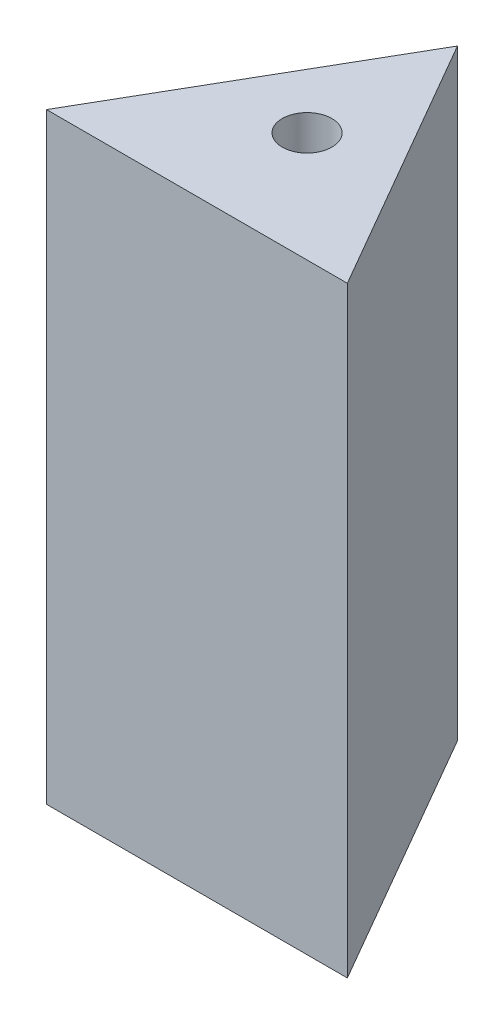
ISO-10303-21;
HEADER;
FILE_DESCRIPTION(('STEP AP214'),'2;1');
FILE_NAME('part.step','',(''),(''),'','','');
FILE_SCHEMA(('AUTOMOTIVE_DESIGN { 1 0 10303 214 1 1 1 1 }'));
ENDSEC;
DATA;
#1=APPLICATION_CONTEXT('core data for automotive mechanical design processes');
#2=APPLICATION_PROTOCOL_DEFINITION('international standard','automotive_design',2000,#1);
#3=PRODUCT_CONTEXT('',#1,'mechanical');
#4=PRODUCT('Part','Part','',(#3));
#5=PRODUCT_RELATED_PRODUCT_CATEGORY('part','',(#4));
#6=PRODUCT_DEFINITION_FORMATION('','',#4);
#7=PRODUCT_DEFINITION_CONTEXT('part definition',#1,'design');
#8=PRODUCT_DEFINITION('design','',#6,#7);
#9=PRODUCT_DEFINITION_SHAPE('','',#8);
#10=(LENGTH_UNIT() NAMED_UNIT(*) SI_UNIT(.MILLI.,.METRE.));
#11=(NAMED_UNIT(*) PLANE_ANGLE_UNIT() SI_UNIT($,.RADIAN.));
#12=(NAMED_UNIT(*) SI_UNIT($,.STERADIAN.) SOLID_ANGLE_UNIT());
#13=UNCERTAINTY_MEASURE_WITH_UNIT(LENGTH_MEASURE(1.E-05),#10,'distance_accuracy_value','');
#14=(GEOMETRIC_REPRESENTATION_CONTEXT(3) GLOBAL_UNCERTAINTY_ASSIGNED_CONTEXT((#13)) GLOBAL_UNIT_ASSIGNED_CONTEXT((#10,
#11,#12)) REPRESENTATION_CONTEXT('',''));
#15=CARTESIAN_POINT('',(0.,0.,0.));
#16=DIRECTION('',(0.,0.,1.));
#17=DIRECTION('',(1.,0.,0.));
#18=AXIS2_PLACEMENT_3D('',#15,#16,#17);
#19=CARTESIAN_POINT('',(0.,40.,0.));
#20=DIRECTION('',(-0.86602540378444,0.,-0.499999999999998));
#21=DIRECTION('',(-0.499999999999998,0.,0.86602540378444));
#22=AXIS2_PLACEMENT_3D('',#19,#20,#21);
#23=PLANE('',#22);
#24=CARTESIAN_POINT('',(4.99999999999998,35.,-8.6602540378444));
#25=DIRECTION('',(-0.86602540378444,0.,-0.499999999999998));
#26=DIRECTION('',(-0.499999999999998,0.,0.86602540378444));
#27=AXIS2_PLACEMENT_3D('',#24,#25,#26);
#28=CIRCLE('',#27,1.64999999999999);
#29=CARTESIAN_POINT('',(4.17499999999998,35.,-7.23131212160008));
#30=VERTEX_POINT('',#29);
#31=EDGE_CURVE('E112',#30,#30,#28,.T.);
#32=ORIENTED_EDGE('',*,*,#31,.F.);
#33=EDGE_LOOP('',(#32));
#34=FACE_BOUND('',#33,.T.);
#35=CARTESIAN_POINT('',(4.99999999999998,5.,-8.6602540378444));
#36=DIRECTION('',(-0.86602540378444,0.,-0.499999999999998));
#37=DIRECTION('',(-0.499999999999998,0.,0.86602540378444));
#38=AXIS2_PLACEMENT_3D('',#35,#36,#37);
#39=CIRCLE('',#38,1.64999999999999);
#40=CARTESIAN_POINT('',(4.17499999999999,5.,-7.23131212160008));
#41=VERTEX_POINT('',#40);
#42=EDGE_CURVE('E118',#41,#41,#39,.T.);
#43=ORIENTED_EDGE('',*,*,#42,.F.);
#44=EDGE_LOOP('',(#43));
#45=FACE_BOUND('',#44,.T.);
#46=DIRECTION('',(0.499999999999998,0.,-0.86602540378444));
#47=VECTOR('',#46,1.);
#48=CARTESIAN_POINT('',(0.,0.,0.));
#49=LINE('',#48,#47);
#50=CARTESIAN_POINT('',(0.,0.,0.));
#51=VERTEX_POINT('',#50);
#52=CARTESIAN_POINT('',(9.99999999999995,0.,-17.3205080756888));
#53=VERTEX_POINT('',#52);
#54=EDGE_CURVE('E147',#51,#53,#49,.T.);
#55=ORIENTED_EDGE('',*,*,#54,.F.);
#56=DIRECTION('',(0.,-1.,0.));
#57=VECTOR('',#56,1.);
#58=CARTESIAN_POINT('',(0.,40.,0.));
#59=LINE('',#58,#57);
#60=CARTESIAN_POINT('',(0.,40.,0.));
#61=VERTEX_POINT('',#60);
#62=EDGE_CURVE('E11',#61,#51,#59,.T.);
#63=ORIENTED_EDGE('',*,*,#62,.F.);
#64=DIRECTION('',(0.499999999999998,0.,-0.86602540378444));
#65=VECTOR('',#64,1.);
#66=CARTESIAN_POINT('',(0.,40.,0.));
#67=LINE('',#66,#65);
#68=CARTESIAN_POINT('',(9.99999999999995,40.,-17.3205080756888));
#69=VERTEX_POINT('',#68);
#70=EDGE_CURVE('E148',#61,#69,#67,.T.);
#71=ORIENTED_EDGE('',*,*,#70,.T.);
#72=DIRECTION('',(0.,-1.,0.));
#73=VECTOR('',#72,1.);
#74=CARTESIAN_POINT('',(9.99999999999995,40.,-17.3205080756888));
#75=LINE('',#74,#73);
#76=EDGE_CURVE('E72',#69,#53,#75,.T.);
#77=ORIENTED_EDGE('',*,*,#76,.T.);
#78=EDGE_LOOP('',(#55,#63,#71,#77));
#79=FACE_BOUND('',#78,.T.);
#80=ADVANCED_FACE('F48',(#34,#45,#79),#23,.T.);
#81=CARTESIAN_POINT('',(0.,40.,0.));
#82=DIRECTION('',(0.,0.,-1.));
#83=DIRECTION('',(-1.,0.,0.));
#84=AXIS2_PLACEMENT_3D('',#81,#82,#83);
#85=PLANE('',#84);
#86=DIRECTION('',(1.,0.,0.));
#87=VECTOR('',#86,1.);
#88=CARTESIAN_POINT('',(0.,0.,0.));
#89=LINE('',#88,#87);
#90=CARTESIAN_POINT('',(20.,0.,0.));
#91=VERTEX_POINT('',#90);
#92=EDGE_CURVE('E159',#51,#91,#89,.T.);
#93=ORIENTED_EDGE('',*,*,#92,.T.);
#94=DIRECTION('',(0.,-1.,0.));
#95=VECTOR('',#94,1.);
#96=CARTESIAN_POINT('',(20.,40.,0.));
#97=LINE('',#96,#95);
#98=CARTESIAN_POINT('',(20.,40.,0.));
#99=VERTEX_POINT('',#98);
#100=EDGE_CURVE('E63',#99,#91,#97,.T.);
#101=ORIENTED_EDGE('',*,*,#100,.F.);
#102=DIRECTION('',(1.,0.,0.));
#103=VECTOR('',#102,1.);
#104=CARTESIAN_POINT('',(0.,40.,0.));
#105=LINE('',#104,#103);
#106=EDGE_CURVE('E151',#61,#99,#105,.T.);
#107=ORIENTED_EDGE('',*,*,#106,.F.);
#108=ORIENTED_EDGE('',*,*,#62,.T.);
#109=EDGE_LOOP('',(#93,#101,#107,#108));
#110=FACE_BOUND('',#109,.T.);
#111=ADVANCED_FACE('F201',(#110),#85,.F.);
#112=CARTESIAN_POINT('',(15.,40.,-8.6602540378444));
#113=DIRECTION('',(0.866025403784438,0.,-0.500000000000001));
#114=DIRECTION('',(-0.500000000000001,0.,-0.866025403784438));
#115=AXIS2_PLACEMENT_3D('',#112,#113,#114);
#116=PLANE('',#115);
#117=DIRECTION('',(0.500000000000001,0.,0.866025403784438));
#118=VECTOR('',#117,1.);
#119=CARTESIAN_POINT('',(15.,0.,-8.6602540378444));
#120=LINE('',#119,#118);
#121=EDGE_CURVE('E152',#53,#91,#120,.T.);
#122=ORIENTED_EDGE('',*,*,#121,.F.);
#123=ORIENTED_EDGE('',*,*,#76,.F.);
#124=DIRECTION('',(0.500000000000001,0.,0.866025403784438));
#125=VECTOR('',#124,1.);
#126=CARTESIAN_POINT('',(15.,40.,-8.6602540378444));
#127=LINE('',#126,#125);
#128=EDGE_CURVE('E154',#69,#99,#127,.T.);
#129=ORIENTED_EDGE('',*,*,#128,.T.);
#130=ORIENTED_EDGE('',*,*,#100,.T.);
#131=EDGE_LOOP('',(#122,#123,#129,#130));
#132=FACE_BOUND('',#131,.T.);
#133=ADVANCED_FACE('F206',(#132),#116,.T.);
#134=CARTESIAN_POINT('',(0.,40.,0.));
#135=DIRECTION('',(0.,1.,0.));
#136=DIRECTION('',(0.,0.,1.));
#137=AXIS2_PLACEMENT_3D('',#134,#135,#136);
#138=PLANE('',#137);
#139=CARTESIAN_POINT('',(9.99999999999995,40.,-7.3205080756888));
#140=DIRECTION('',(0.,1.,0.));
#141=DIRECTION('',(0.,0.,1.));
#142=AXIS2_PLACEMENT_3D('',#139,#140,#141);
#143=CIRCLE('',#142,1.64999999999999);
#144=CARTESIAN_POINT('',(9.99999999999995,40.,-5.67050807568881));
#145=VERTEX_POINT('',#144);
#146=EDGE_CURVE('E131',#145,#145,#143,.T.);
#147=ORIENTED_EDGE('',*,*,#146,.F.);
#148=EDGE_LOOP('',(#147));
#149=FACE_BOUND('',#148,.T.);
#150=ORIENTED_EDGE('',*,*,#70,.F.);
#151=ORIENTED_EDGE('',*,*,#106,.T.);
#152=ORIENTED_EDGE('',*,*,#128,.F.);
#153=EDGE_LOOP('',(#150,#151,#152));
#154=FACE_BOUND('',#153,.T.);
#155=ADVANCED_FACE('F215',(#149,#154),#138,.T.);
#156=CARTESIAN_POINT('',(0.,0.,0.));
#157=DIRECTION('',(0.,1.,0.));
#158=DIRECTION('',(0.,0.,1.));
#159=AXIS2_PLACEMENT_3D('',#156,#157,#158);
#160=PLANE('',#159);
#161=CARTESIAN_POINT('',(9.99999999999995,0.,-7.3205080756888));
#162=DIRECTION('',(0.,-1.,0.));
#163=DIRECTION('',(0.,0.,-1.));
#164=AXIS2_PLACEMENT_3D('',#161,#162,#163);
#165=CIRCLE('',#164,1.64999999999999);
#166=CARTESIAN_POINT('',(9.99999999999995,0.,-8.97050807568879));
#167=VERTEX_POINT('',#166);
#168=EDGE_CURVE('E139',#167,#167,#165,.T.);
#169=ORIENTED_EDGE('',*,*,#168,.F.);
#170=EDGE_LOOP('',(#169));
#171=FACE_BOUND('',#170,.T.);
#172=ORIENTED_EDGE('',*,*,#54,.T.);
#173=ORIENTED_EDGE('',*,*,#121,.T.);
#174=ORIENTED_EDGE('',*,*,#92,.F.);
#175=EDGE_LOOP('',(#172,#173,#174));
#176=FACE_BOUND('',#175,.T.);
#177=ADVANCED_FACE('F213',(#171,#176),#160,.F.);
#178=CARTESIAN_POINT('',(9.99999999999995,10.1,-7.3205080756888));
#179=DIRECTION('',(0.,-1.,0.));
#180=DIRECTION('',(0.,0.,-1.));
#181=AXIS2_PLACEMENT_3D('',#178,#179,#180);
#182=CONICAL_SURFACE('',#181,1.64999999999999,1.02974425867665);
#183=CARTESIAN_POINT('',(9.99999999999995,11.0914200213955,-7.3205080756888));
#184=VERTEX_POINT('',#183);
#185=VERTEX_LOOP('',#184);
#186=FACE_BOUND('',#185,.T.);
#187=CARTESIAN_POINT('',(9.99999999999995,10.1,-7.3205080756888));
#188=DIRECTION('',(0.,-1.,0.));
#189=DIRECTION('',(0.,0.,-1.));
#190=AXIS2_PLACEMENT_3D('',#187,#188,#189);
#191=CIRCLE('',#190,1.64999999999999);
#192=CARTESIAN_POINT('',(9.99999999999995,10.1,-8.97050807568879));
#193=VERTEX_POINT('',#192);
#194=EDGE_CURVE('E143',#193,#193,#191,.T.);
#195=ORIENTED_EDGE('',*,*,#194,.T.);
#196=EDGE_LOOP('',(#195));
#197=FACE_BOUND('',#196,.T.);
#198=ADVANCED_FACE('F197',(#186,#197),#182,.F.);
#199=CARTESIAN_POINT('',(9.99999999999995,0.,-7.3205080756888));
#200=DIRECTION('',(0.,-1.,0.));
#201=DIRECTION('',(0.,0.,-1.));
#202=AXIS2_PLACEMENT_3D('',#199,#200,#201);
#203=CYLINDRICAL_SURFACE('',#202,1.64999999999999);
#204=CARTESIAN_POINT('',(9.17499999999996,6.62056855208325,-5.89156615944448));
#205=CARTESIAN_POINT('',(9.0950065106871,6.62057728312591,-5.93775620613238));
#206=CARTESIAN_POINT('',(9.018815360023,6.62212015528902,-5.99073388845692));
#207=CARTESIAN_POINT('',(8.87632766336162,6.62757571653433,-6.10871243227145));
#208=CARTESIAN_POINT('',(8.81005099317283,6.63149308851148,-6.1737368755003));
#209=CARTESIAN_POINT('',(8.68937768446973,6.63961830374698,-6.3138766012833));
#210=CARTESIAN_POINT('',(8.63496817497862,6.64382582572503,-6.38898080714365));
#211=CARTESIAN_POINT('',(8.53943677922101,6.64950967333554,-6.5473322504309));
#212=CARTESIAN_POINT('',(8.49831348814443,6.65098628779687,-6.63057862573722));
#213=CARTESIAN_POINT('',(8.43091581754387,6.64757157018664,-6.80198058496081));
#214=CARTESIAN_POINT('',(8.40451206530628,6.64273700917707,-6.89008566792048));
#215=CARTESIAN_POINT('',(8.36685020026233,6.62303619907077,-7.06836289308038));
#216=CARTESIAN_POINT('',(8.35556468561296,6.60818817307173,-7.15853099341142));
#217=CARTESIAN_POINT('',(8.34820999400219,6.56833134778696,-7.32424145469683));
#218=CARTESIAN_POINT('',(8.35027494285499,6.54498511396969,-7.40010091953635));
#219=CARTESIAN_POINT('',(8.36392472118161,6.4875535367764,-7.54671934730636));
#220=CARTESIAN_POINT('',(8.37550559456389,6.45347265978471,-7.61748041651784));
#221=CARTESIAN_POINT('',(8.40408382268058,6.37904827327654,-7.74395623961033));
#222=CARTESIAN_POINT('',(8.42036502243756,6.33977193286746,-7.80047073868484));
#223=CARTESIAN_POINT('',(8.45639866127513,6.25361981714219,-7.9060945287253));
#224=CARTESIAN_POINT('',(8.4761519930692,6.2067420876876,-7.95520190921261));
#225=CARTESIAN_POINT('',(8.51837653585419,6.10297540420791,-8.04858846096367));
#226=CARTESIAN_POINT('',(8.54094123559613,6.0456198731919,-8.09230398681993));
#227=CARTESIAN_POINT('',(8.58517602818259,5.92471563176458,-8.17068566126068));
#228=CARTESIAN_POINT('',(8.60684556333728,5.86116314106498,-8.20534623808926));
#229=CARTESIAN_POINT('',(8.65025119224537,5.71913765707346,-8.27047612649046));
#230=CARTESIAN_POINT('',(8.67150315629954,5.63986078956369,-8.29952205079621));
#231=CARTESIAN_POINT('',(8.7074558600533,5.4766636590717,-8.34652381711916));
#232=CARTESIAN_POINT('',(8.72215491645416,5.3927422092142,-8.36447681006142));
#233=CARTESIAN_POINT('',(8.74389054881441,5.21634058759486,-8.39055853524838));
#234=CARTESIAN_POINT('',(8.75032576028694,5.12367025314526,-8.39792052860569));
#235=CARTESIAN_POINT('',(8.75263712402621,4.93803481343202,-8.4005954820787));
#236=CARTESIAN_POINT('',(8.74851407022379,4.84506973085704,-8.39590934815561));
#237=CARTESIAN_POINT('',(8.73047586894494,4.66304250813299,-8.37454535050465));
#238=CARTESIAN_POINT('',(8.71671887879673,4.57394168008448,-8.35806107814635));
#239=CARTESIAN_POINT('',(8.68148287203353,4.40042308248582,-8.31289247690231));
#240=CARTESIAN_POINT('',(8.65999855120347,4.3160085757905,-8.28419976538533));
#241=CARTESIAN_POINT('',(8.61178738047796,4.15272310600474,-8.21338538889441));
#242=CARTESIAN_POINT('',(8.58497571990454,4.07397433771668,-8.17103848366865));
#243=CARTESIAN_POINT('',(8.53025961661518,3.92611563862579,-8.07251717992573));
#244=CARTESIAN_POINT('',(8.50235677046275,3.85699225398724,-8.01636239144599));
#245=CARTESIAN_POINT('',(8.45551899889415,3.74394440567712,-7.90359206899782));
#246=CARTESIAN_POINT('',(8.43592617450226,3.69776944390065,-7.84950401329098));
#247=CARTESIAN_POINT('',(8.40143069680591,3.6140783705466,-7.73368434115938));
#248=CARTESIAN_POINT('',(8.38652384251046,3.57655451131422,-7.67195964061189));
#249=CARTESIAN_POINT('',(8.36365700367066,3.51068713069857,-7.54235875914068));
#250=CARTESIAN_POINT('',(8.35571711929936,3.4823703192351,-7.47446539902355));
#251=CARTESIAN_POINT('',(8.34859032074093,3.43490102226396,-7.33510504472801));
#252=CARTESIAN_POINT('',(8.34940546151259,3.41575068939229,-7.2636372154769));
#253=CARTESIAN_POINT('',(8.36042372463993,3.38621161082654,-7.12285043814078));
#254=CARTESIAN_POINT('',(8.37022786910521,3.37548620761863,-7.05356863722299));
#255=CARTESIAN_POINT('',(8.39876059433998,3.36000381133538,-6.91620653314675));
#256=CARTESIAN_POINT('',(8.4174921187075,3.35524878873651,-6.84812663397164));
#257=CARTESIAN_POINT('',(8.46595279199071,3.34974882936912,-6.70793001594906));
#258=CARTESIAN_POINT('',(8.49661589912675,3.34946732550104,-6.6361196602949));
#259=CARTESIAN_POINT('',(8.56774450961733,3.35186340224287,-6.4975742946328));
#260=CARTESIAN_POINT('',(8.60821653298325,3.35454295530935,-6.43084269942023));
#261=CARTESIAN_POINT('',(8.70467618799558,3.36130198024836,-6.29455868572356));
#262=CARTESIAN_POINT('',(8.76206214690745,3.36552801848301,-6.22599804574556));
#263=CARTESIAN_POINT('',(8.88717693121033,3.37281879910339,-6.09900362198784));
#264=CARTESIAN_POINT('',(8.95490612356029,3.37588350027359,-6.04057019766024));
#265=CARTESIAN_POINT('',(9.10176573093702,3.37948307503935,-5.93333381623603));
#266=CARTESIAN_POINT('',(9.18123586881121,3.3799154844936,-5.88499091912469));
#267=CARTESIAN_POINT('',(9.34712668069609,3.37776451498971,-5.80233546943774));
#268=CARTESIAN_POINT('',(9.43354804311838,3.37518083699137,-5.76802430854158));
#269=CARTESIAN_POINT('',(9.60963000145744,3.36831723375883,-5.71474973036661));
#270=CARTESIAN_POINT('',(9.69923046791084,3.36406088423951,-5.69558369436433));
#271=CARTESIAN_POINT('',(9.88045368672696,3.3562173126535,-5.67230939296401));
#272=CARTESIAN_POINT('',(9.97207755558847,3.35263047088316,-5.66820966102799));
#273=CARTESIAN_POINT('',(10.1563436331991,3.34927117463885,-5.6753059154323));
#274=CARTESIAN_POINT('',(10.2489782837977,3.34956147368891,-5.68675084338906));
#275=CARTESIAN_POINT('',(10.4306511301496,3.35796069265118,-5.72500781770346));
#276=CARTESIAN_POINT('',(10.5196938825947,3.36605935963086,-5.75179969372363));
#277=CARTESIAN_POINT('',(10.6823018973871,3.39249161636723,-5.81589839251178));
#278=CARTESIAN_POINT('',(10.7565317364868,3.40976342080881,-5.85194276052174));
#279=CARTESIAN_POINT('',(10.8961361187467,3.45580787626057,-5.93273149988015));
#280=CARTESIAN_POINT('',(10.9615206718314,3.48456737877126,-5.97746589489945));
#281=CARTESIAN_POINT('',(11.0726637405805,3.54919229525215,-6.06504951386338));
#282=CARTESIAN_POINT('',(11.1198923723397,3.58344224834852,-6.10724555244918));
#283=CARTESIAN_POINT('',(11.2058112849444,3.66040003182696,-6.19259514384596));
#284=CARTESIAN_POINT('',(11.244499435005,3.70310996787867,-6.23574893265947));
#285=CARTESIAN_POINT('',(11.3139835963412,3.79657983916236,-6.32100112102265));
#286=CARTESIAN_POINT('',(11.344682653558,3.84742756741557,-6.36308142461793));
#287=CARTESIAN_POINT('',(11.398477364069,3.95564911554654,-6.4435211628984));
#288=CARTESIAN_POINT('',(11.4215696483614,4.01302581197629,-6.48187894360592));
#289=CARTESIAN_POINT('',(11.4641076293617,4.14172850386096,-6.55823062294841));
#290=CARTESIAN_POINT('',(11.4825626807821,4.21387667593928,-6.59539145819756));
#291=CARTESIAN_POINT('',(11.5127007477495,4.36353720577467,-6.66056260205528));
#292=CARTESIAN_POINT('',(11.5243800211655,4.44105250128999,-6.68856785049104));
#293=CARTESIAN_POINT('',(11.5433659168083,4.60848832655109,-6.73632974979146));
#294=CARTESIAN_POINT('',(11.5500533083864,4.69883754561039,-6.7548465842501));
#295=CARTESIAN_POINT('',(11.5580564546978,4.88155058570345,-6.7772720518497));
#296=CARTESIAN_POINT('',(11.5593731353059,4.97391405673319,-6.78118320290349));
#297=CARTESIAN_POINT('',(11.5569102247543,5.15764849002569,-6.77411750051036));
#298=CARTESIAN_POINT('',(11.5531498823316,5.24902188445605,-6.76319687847808));
#299=CARTESIAN_POINT('',(11.5398293763359,5.42857932962208,-6.72739356883398));
#300=CARTESIAN_POINT('',(11.5302666784927,5.51676196890197,-6.70250478076218));
#301=CARTESIAN_POINT('',(11.5036720249619,5.68799802493268,-6.64035271475505));
#302=CARTESIAN_POINT('',(11.4866014813701,5.77102238006732,-6.60302575204473));
#303=CARTESIAN_POINT('',(11.4427812065985,5.92918217743154,-6.51854409305505));
#304=CARTESIAN_POINT('',(11.4160307961263,6.00431706553393,-6.47138870715673));
#305=CARTESIAN_POINT('',(11.3509139861766,6.14328186752294,-6.37128980717418));
#306=CARTESIAN_POINT('',(11.3127361876636,6.20727048816862,-6.31844857777754));
#307=CARTESIAN_POINT('',(11.2455210479216,6.29396128900526,-6.23773143154284));
#308=CARTESIAN_POINT('',(11.2214645526346,6.32130435291621,-6.21058952659019));
#309=CARTESIAN_POINT('',(11.1699598705476,6.37270719810847,-6.15642371625931));
#310=CARTESIAN_POINT('',(11.1425124235999,6.39676769319238,-6.12939978646826));
#311=CARTESIAN_POINT('',(11.0635628895998,6.45724436513216,-6.05723360628345));
#312=CARTESIAN_POINT('',(11.0087855036538,6.49035214865863,-6.01280558484151));
#313=CARTESIAN_POINT('',(10.8904717468452,6.54621287233874,-5.92954017230711));
#314=CARTESIAN_POINT('',(10.8269371237245,6.56896787478036,-5.8907016688299));
#315=CARTESIAN_POINT('',(10.6992400241049,6.60346401024698,-5.82442508044957));
#316=CARTESIAN_POINT('',(10.635663018512,6.61602021289619,-5.79627039725351));
#317=CARTESIAN_POINT('',(10.504655849112,6.63476244881825,-5.74802605713055));
#318=CARTESIAN_POINT('',(10.4372249468165,6.64094725684763,-5.72793795189037));
#319=CARTESIAN_POINT('',(10.2942957310085,6.64891799659864,-5.6951730739233));
#320=CARTESIAN_POINT('',(10.2185985849698,6.65028580614559,-5.68327047235066));
#321=CARTESIAN_POINT('',(10.0662685767105,6.64961728442151,-5.67006401576224));
#322=CARTESIAN_POINT('',(9.98963486553828,6.64757759564969,-5.66877062170997));
#323=CARTESIAN_POINT('',(9.82549561682887,6.64165992642467,-5.67740791556438));
#324=CARTESIAN_POINT('',(9.7380866991071,6.63755177857722,-5.68905431662507));
#325=CARTESIAN_POINT('',(9.56630444343028,6.62995054629521,-5.72610871385099));
#326=CARTESIAN_POINT('',(9.48192685551274,6.62645657168427,-5.75149657174188));
#327=CARTESIAN_POINT('',(9.36132412668677,6.62294288245285,-5.79855725295131));
#328=CARTESIAN_POINT('',(9.3230886803241,6.62206227165911,-5.81517548029569));
#329=CARTESIAN_POINT('',(9.24797735012731,6.62087313923486,-5.85125705137023));
#330=CARTESIAN_POINT('',(9.21110145231553,6.62056461172107,-5.87072036583952));
#331=CARTESIAN_POINT('',(9.17499999999996,6.62056855208325,-5.89156615944448));
#332=B_SPLINE_CURVE_WITH_KNOTS('',3,(#204,#205,#206,#207,#208,#209,#210,#211,#212,#213,#214,
#215,#216,#217,#218,#219,#220,#221,#222,#223,#224,#225,#226,#227,#228,#229,#230,#231,#232,#233,
#234,#235,#236,#237,#238,#239,#240,#241,#242,#243,#244,#245,#246,#247,#248,#249,#250,#251,#252,
#253,#254,#255,#256,#257,#258,#259,#260,#261,#262,#263,#264,#265,#266,#267,#268,#269,#270,#271,
#272,#273,#274,#275,#276,#277,#278,#279,#280,#281,#282,#283,#284,#285,#286,#287,#288,#289,#290,
#291,#292,#293,#294,#295,#296,#297,#298,#299,#300,#301,#302,#303,#304,#305,#306,#307,#308,#309,
#310,#311,#312,#313,#314,#315,#316,#317,#318,#319,#320,#321,#322,#323,#324,#325,#326,#327,#328,
#329,#330,#331),.UNSPECIFIED.,.T.,.F.,(4,2,2,2,2,2,2,2,2,2,2,2,2,2,2,2,2,2,2,2,2,2,2,2,2,2,2,2,
2,2,2,2,2,2,2,2,2,2,2,2,2,2,2,2,2,2,2,2,2,2,2,2,2,2,2,2,2,2,2,2,2,2,2,4),(0.,0.276957007337639,
0.55446200360733,0.831664507948762,1.10883769285577,1.38353471368341,1.65773316877568,
1.89452344809238,2.13121533546157,2.34246129530059,2.55376164785741,2.77958154386932,
3.00554006744085,3.26562157120265,3.52576984577528,3.80394002633886,4.08208929045505,
4.35577616145734,4.62965125699657,4.90829758434612,5.18655043934675,5.40690144672012,
5.62705434139653,5.84784032302904,6.0686781281573,6.28016497250628,6.49172159806871,
6.72506635234343,6.9585666389174,7.22589289651105,7.49322864055443,7.77090736414491,
8.04861362147058,8.3225385344514,8.59661857292817,8.87514004119187,9.15329628867748,
9.4046411466343,9.65569914283943,9.87067248476836,10.0856994004373,10.3032255051585,
10.5208478219774,10.7695257438388,11.0183408752839,11.2944151899404,11.5704419092098,
11.8454250497879,12.1205283801276,12.3970624843991,12.6736159984375,12.9458356994585,
13.0818834608545,13.2179015910182,13.4501927135466,13.6824375430881,13.8935061071411,
14.1046152529106,14.3336505644625,14.5629116838677,14.8266211893744,15.0899452676382,
15.2149386027924,15.3399306525173),.UNSPECIFIED.);
#333=CARTESIAN_POINT('',(9.17499999999996,6.62056855208325,-5.89156615944448));
#334=VERTEX_POINT('',#333);
#335=EDGE_CURVE('E130',#334,#334,#332,.T.);
#336=ORIENTED_EDGE('',*,*,#335,.T.);
#337=EDGE_LOOP('',(#336));
#338=FACE_BOUND('',#337,.T.);
#339=ORIENTED_EDGE('',*,*,#194,.F.);
#340=EDGE_LOOP('',(#339));
#341=FACE_BOUND('',#340,.T.);
#342=ORIENTED_EDGE('',*,*,#168,.T.);
#343=EDGE_LOOP('',(#342));
#344=FACE_BOUND('',#343,.T.);
#345=ADVANCED_FACE('F175',(#338,#341,#344),#203,.F.);
#346=CARTESIAN_POINT('',(9.99999999999995,29.9,-7.3205080756888));
#347=DIRECTION('',(0.,1.,0.));
#348=DIRECTION('',(0.,0.,1.));
#349=AXIS2_PLACEMENT_3D('',#346,#347,#348);
#350=CONICAL_SURFACE('',#349,1.64999999999999,1.02974425867665);
#351=CARTESIAN_POINT('',(9.99999999999995,28.9085799786045,-7.3205080756888));
#352=VERTEX_POINT('',#351);
#353=VERTEX_LOOP('',#352);
#354=FACE_BOUND('',#353,.T.);
#355=CARTESIAN_POINT('',(9.99999999999995,29.9,-7.3205080756888));
#356=DIRECTION('',(0.,1.,0.));
#357=DIRECTION('',(0.,0.,1.));
#358=AXIS2_PLACEMENT_3D('',#355,#356,#357);
#359=CIRCLE('',#358,1.64999999999999);
#360=CARTESIAN_POINT('',(9.99999999999995,29.9,-5.67050807568881));
#361=VERTEX_POINT('',#360);
#362=EDGE_CURVE('E135',#361,#361,#359,.T.);
#363=ORIENTED_EDGE('',*,*,#362,.T.);
#364=EDGE_LOOP('',(#363));
#365=FACE_BOUND('',#364,.T.);
#366=ADVANCED_FACE('F190',(#354,#365),#350,.F.);
#367=CARTESIAN_POINT('',(9.99999999999995,40.,-7.3205080756888));
#368=DIRECTION('',(0.,1.,0.));
#369=DIRECTION('',(0.,0.,1.));
#370=AXIS2_PLACEMENT_3D('',#367,#368,#369);
#371=CYLINDRICAL_SURFACE('',#370,1.64999999999999);
#372=CARTESIAN_POINT('',(9.99999999999995,33.3524126482113,-5.67050807568881));
#373=CARTESIAN_POINT('',(10.081112543242,33.350216056,-5.67051080232871));
#374=CARTESIAN_POINT('',(10.1623270823237,33.3492278065194,-5.67650659104876));
#375=CARTESIAN_POINT('',(10.3230138867068,33.352150180392,-5.70039495593045));
#376=CARTESIAN_POINT('',(10.4024840652774,33.3560663770093,-5.71830105576016));
#377=CARTESIAN_POINT('',(10.5578018206671,33.3714710609687,-5.76552471294593));
#378=CARTESIAN_POINT('',(10.6336247433828,33.3830049357144,-5.79491023524031));
#379=CARTESIAN_POINT('',(10.7783380093792,33.4160334417511,-5.8634290600717));
#380=CARTESIAN_POINT('',(10.8472378351904,33.4375142160947,-5.90254876703098));
#381=CARTESIAN_POINT('',(10.9695820251389,33.4892245110804,-5.98361414957739));
#382=CARTESIAN_POINT('',(11.0238725456639,33.5184306128254,-6.02493956259144));
#383=CARTESIAN_POINT('',(11.1236436859592,33.5862071139806,-6.11044811748076));
#384=CARTESIAN_POINT('',(11.1691225727258,33.6247793520956,-6.15463181922747));
#385=CARTESIAN_POINT('',(11.2493235478375,33.7088000729151,-6.241139678805));
#386=CARTESIAN_POINT('',(11.2844092126693,33.7539032193057,-6.28346605551159));
#387=CARTESIAN_POINT('',(11.3467541106055,33.8510493424241,-6.36582231037757));
#388=CARTESIAN_POINT('',(11.3740108123807,33.9030945557751,-6.40585144243155));
#389=CARTESIAN_POINT('',(11.424391950104,34.0194414100361,-6.48617350225781));
#390=CARTESIAN_POINT('',(11.4466644044845,34.0844645618191,-6.52595332535767));
#391=CARTESIAN_POINT('',(11.4840999303842,34.2203318042826,-6.59828320552349));
#392=CARTESIAN_POINT('',(11.4992582012336,34.2911797877964,-6.63082837285181));
#393=CARTESIAN_POINT('',(11.5255742348073,34.4473807634725,-6.69094211862587));
#394=CARTESIAN_POINT('',(11.5358892438064,34.5333849744185,-6.71720070981891));
#395=CARTESIAN_POINT('',(11.550730388182,34.708846315268,-6.75643407844685));
#396=CARTESIAN_POINT('',(11.5552568447823,34.7983032532857,-6.76940959299049));
#397=CARTESIAN_POINT('',(11.5594172187285,34.9805279437713,-6.78128286196868));
#398=CARTESIAN_POINT('',(11.5589258419334,35.0733225215163,-6.77982012649379));
#399=CARTESIAN_POINT('',(11.5526478940264,35.2573034182796,-6.76205595922239));
#400=CARTESIAN_POINT('',(11.5468602988242,35.3484894227842,-6.74575165762617));
#401=CARTESIAN_POINT('',(11.5289774309009,35.5258040841664,-6.69976357083054));
#402=CARTESIAN_POINT('',(11.516944207241,35.6119733813146,-6.67021178343793));
#403=CARTESIAN_POINT('',(11.4847635525895,35.7779937282508,-6.59976442416662));
#404=CARTESIAN_POINT('',(11.4646120850825,35.8578416112688,-6.55886321233339));
#405=CARTESIAN_POINT('',(11.4136151826462,36.0098342343352,-6.46790139009206));
#406=CARTESIAN_POINT('',(11.3826484739106,36.0818789339844,-6.4177400862214));
#407=CARTESIAN_POINT('',(11.3077798228913,36.2146452226699,-6.31236118968293));
#408=CARTESIAN_POINT('',(11.2638981852862,36.2753843433119,-6.25715162704038));
#409=CARTESIAN_POINT('',(11.1676323639343,36.3772389354289,-6.15278130487907));
#410=CARTESIAN_POINT('',(11.1167583592056,36.419792774991,-6.1036381998481));
#411=CARTESIAN_POINT('',(11.0041919139268,36.4932618209342,-6.00922250169101));
#412=CARTESIAN_POINT('',(10.9425089191304,36.5241871156361,-5.96394658007893));
#413=CARTESIAN_POINT('',(10.8190040671693,36.5713515737013,-5.8865183448754));
#414=CARTESIAN_POINT('',(10.7582992508425,36.588999856979,-5.85342100006593));
#415=CARTESIAN_POINT('',(10.6318067669361,36.6168611695054,-5.79466928195697));
#416=CARTESIAN_POINT('',(10.5660177899066,36.6270722761669,-5.76901683427072));
#417=CARTESIAN_POINT('',(10.4289128469251,36.6418188530768,-5.72555390380111));
#418=CARTESIAN_POINT('',(10.3574862178948,36.6461563523456,-5.70802947330216));
#419=CARTESIAN_POINT('',(10.2128177215417,36.6504436559477,-5.68264001577128));
#420=CARTESIAN_POINT('',(10.1395749550879,36.650391241748,-5.67477987482254));
#421=CARTESIAN_POINT('',(9.98187535581935,36.6475836092985,-5.66845414853004));
#422=CARTESIAN_POINT('',(9.89736173620811,36.6444298876827,-5.6715495403822));
#423=CARTESIAN_POINT('',(9.7298168127758,36.6373278545296,-5.69059421746626));
#424=CARTESIAN_POINT('',(9.64678621012357,36.6333791774275,-5.70654942653475));
#425=CARTESIAN_POINT('',(9.47624218304793,36.6263268845459,-5.75311720728206));
#426=CARTESIAN_POINT('',(9.38906380186691,36.6233408114164,-5.78499002880468));
#427=CARTESIAN_POINT('',(9.22124818501784,36.6202652328118,-5.862906140659));
#428=CARTESIAN_POINT('',(9.14060990638518,36.6201752645791,-5.90894716591929));
#429=CARTESIAN_POINT('',(8.98900651247045,36.6229151819619,-6.01330710802175));
#430=CARTESIAN_POINT('',(8.91795034317655,36.625715011607,-6.07149471878846));
#431=CARTESIAN_POINT('',(8.78646451490477,36.6328340692689,-6.19880659048844));
#432=CARTESIAN_POINT('',(8.72604026880607,36.6371540678896,-6.26793638843647));
#433=CARTESIAN_POINT('',(8.6168702637759,36.6448808218925,-6.41607275739581));
#434=CARTESIAN_POINT('',(8.56825435186052,36.6482774684309,-6.4951757778939));
#435=CARTESIAN_POINT('',(8.48492909190779,36.6507461493615,-6.66048782809497));
#436=CARTESIAN_POINT('',(8.45021731729094,36.6498189387198,-6.74669561468986));
#437=CARTESIAN_POINT('',(8.3966554447353,36.6399385518972,-6.92077098667278));
#438=CARTESIAN_POINT('',(8.37735667606308,36.6312293728864,-7.00850916844116));
#439=CARTESIAN_POINT('',(8.35928662151416,36.6099315898147,-7.14013102815528));
#440=CARTESIAN_POINT('',(8.35507602891295,36.6014626402816,-7.1839981817611));
#441=CARTESIAN_POINT('',(8.35015842217406,36.5814606972814,-7.2712224411165));
#442=CARTESIAN_POINT('',(8.34945066990818,36.5699283498816,-7.31457965240131));
#443=CARTESIAN_POINT('',(8.35204336986503,36.534341923256,-7.43000829734284));
#444=CARTESIAN_POINT('',(8.35847084786794,36.5071552742846,-7.50109690098349));
#445=CARTESIAN_POINT('',(8.3792283154511,36.4428092108503,-7.63730566929178));
#446=CARTESIAN_POINT('',(8.39355798188425,36.4056502042226,-7.70242607789204));
#447=CARTESIAN_POINT('',(8.4264049870175,36.3249651776189,-7.82028387308289));
#448=CARTESIAN_POINT('',(8.44454798224123,36.2820874900508,-7.87357455008587));
#449=CARTESIAN_POINT('',(8.48331706421065,36.189178651893,-7.97242576426599));
#450=CARTESIAN_POINT('',(8.50394383047293,36.1391455429985,-8.0179841777788));
#451=CARTESIAN_POINT('',(8.54768825774076,36.0276344880368,-8.10531046695733));
#452=CARTESIAN_POINT('',(8.57084705920792,35.9655109802014,-8.146230553297));
#453=CARTESIAN_POINT('',(8.61515955459616,35.8352952804912,-8.21857248371221));
#454=CARTESIAN_POINT('',(8.63631187793069,35.7671990690249,-8.24998786692718));
#455=CARTESIAN_POINT('',(8.67727993072549,35.6161302056406,-8.30759715405534));
#456=CARTESIAN_POINT('',(8.69645290934923,35.5324349598118,-8.33236534780126));
#457=CARTESIAN_POINT('',(8.7269099943466,35.3610962732445,-8.37043189802507));
#458=CARTESIAN_POINT('',(8.73819373479482,35.2734526495697,-8.38372972248114));
#459=CARTESIAN_POINT('',(8.75163251615911,35.0928744549477,-8.39948822689301));
#460=CARTESIAN_POINT('',(8.75339849539816,34.9998695101466,-8.40148719278297));
#461=CARTESIAN_POINT('',(8.7464835771162,34.8147732450078,-8.39345800759482));
#462=CARTESIAN_POINT('',(8.73780177037794,34.7226820048884,-8.38342880976756));
#463=CARTESIAN_POINT('',(8.71145094646785,34.543331249762,-8.35131334760167));
#464=CARTESIAN_POINT('',(8.69390958209132,34.456022108719,-8.32939802197152));
#465=CARTESIAN_POINT('',(8.65229361254115,34.2871106455117,-8.27308760727219));
#466=CARTESIAN_POINT('',(8.62821527386889,34.2055116181969,-8.23868538269559));
#467=CARTESIAN_POINT('',(8.57636283295845,34.0489731515801,-8.15607446852706));
#468=CARTESIAN_POINT('',(8.54853402010314,33.9741667338283,-8.10764608911853));
#469=CARTESIAN_POINT('',(8.49375149522565,33.8352784925692,-7.99690177717854));
#470=CARTESIAN_POINT('',(8.46679671307982,33.7711831219292,-7.93460362319647));
#471=CARTESIAN_POINT('',(8.42088132535234,33.6615033304292,-7.80345445450149));
#472=CARTESIAN_POINT('',(8.40140695803749,33.6147441639344,-7.73577288697829));
#473=CARTESIAN_POINT('',(8.37080881239227,33.5332889056821,-7.59183559822868));
#474=CARTESIAN_POINT('',(8.35967523328596,33.4985786817419,-7.51559006160764));
#475=CARTESIAN_POINT('',(8.34933823960992,33.4453894063925,-7.36942146622881));
#476=CARTESIAN_POINT('',(8.34864032817362,33.4252875344918,-7.3001823656818));
#477=CARTESIAN_POINT('',(8.35629748695055,33.3930170574184,-7.16037548753369));
#478=CARTESIAN_POINT('',(8.36465477852911,33.3808504000356,-7.0898073880847));
#479=CARTESIAN_POINT('',(8.39075845392757,33.3629157437146,-6.94899850281213));
#480=CARTESIAN_POINT('',(8.40858628265804,33.3572046146255,-6.87876597206062));
#481=CARTESIAN_POINT('',(8.45339270665811,33.3505506149601,-6.74106256517181));
#482=CARTESIAN_POINT('',(8.48037538558866,33.3496098752804,-6.67359293654722));
#483=CARTESIAN_POINT('',(8.5474119042643,33.350739815705,-6.53352755543925));
#484=CARTESIAN_POINT('',(8.58877711422658,33.3532566891272,-6.46156265081382));
#485=CARTESIAN_POINT('',(8.6817917361604,33.359643948415,-6.32467437413249));
#486=CARTESIAN_POINT('',(8.73344611111392,33.3635149881472,-6.25975442364782));
#487=CARTESIAN_POINT('',(8.85219791981234,33.3709861182103,-6.13160218865317));
#488=CARTESIAN_POINT('',(8.92037333079623,33.3745083722647,-6.06935805121734));
#489=CARTESIAN_POINT('',(9.06621808303003,33.3789410062028,-5.9570480211898));
#490=CARTESIAN_POINT('',(9.14388980864416,33.379850728714,-5.90698519659379));
#491=CARTESIAN_POINT('',(9.30629361743146,33.3786321662446,-5.8206019437167));
#492=CARTESIAN_POINT('',(9.39101120163015,33.3765099814542,-5.78425410676576));
#493=CARTESIAN_POINT('',(9.56515094654435,33.3702517657062,-5.72620257712403));
#494=CARTESIAN_POINT('',(9.65456603231995,33.3661186899601,-5.70447750609463));
#495=CARTESIAN_POINT('',(9.78722314300582,33.3602361849889,-5.68372710695251));
#496=CARTESIAN_POINT('',(9.8296092561449,33.3583930806393,-5.67877530607732));
#497=CARTESIAN_POINT('',(9.91465415974283,33.3550593083695,-5.67216504077302));
#498=CARTESIAN_POINT('',(9.95731295551726,33.3535686473415,-5.67050664074184));
#499=CARTESIAN_POINT('',(9.99999999999995,33.3524126482113,-5.67050807568881));
#500=B_SPLINE_CURVE_WITH_KNOTS('',3,(#372,#373,#374,#375,#376,#377,#378,#379,#380,#381,#382,
#383,#384,#385,#386,#387,#388,#389,#390,#391,#392,#393,#394,#395,#396,#397,#398,#399,#400,#401,
#402,#403,#404,#405,#406,#407,#408,#409,#410,#411,#412,#413,#414,#415,#416,#417,#418,#419,#420,
#421,#422,#423,#424,#425,#426,#427,#428,#429,#430,#431,#432,#433,#434,#435,#436,#437,#438,#439,
#440,#441,#442,#443,#444,#445,#446,#447,#448,#449,#450,#451,#452,#453,#454,#455,#456,#457,#458,
#459,#460,#461,#462,#463,#464,#465,#466,#467,#468,#469,#470,#471,#472,#473,#474,#475,#476,#477,
#478,#479,#480,#481,#482,#483,#484,#485,#486,#487,#488,#489,#490,#491,#492,#493,#494,#495,#496,
#497,#498,#499),.UNSPECIFIED.,.T.,.F.,(4,2,2,2,2,2,2,2,2,2,2,2,2,2,2,2,2,2,2,2,2,2,2,2,2,2,2,2,
2,2,2,2,2,2,2,2,2,2,2,2,2,2,2,2,2,2,2,2,2,2,2,2,2,2,2,2,2,2,2,2,2,2,2,4),(0.,0.243292978810424,
0.486862679436987,0.731896861559384,0.976590710725242,1.19806870747104,1.41959021867189,
1.63206091137691,1.84460022484841,2.08191329795334,2.31938628111067,2.58968881705224,
2.85997635246551,3.13702908215751,3.41413539479137,3.68853996307798,3.9630811382455,
4.24080525588074,4.51809505080822,4.76421592152605,5.0101227752221,5.22321331167841,
5.43635891471296,5.65652338575596,5.87679912210786,6.1296458672854,6.38260915217791,
6.65986097599374,6.93706849855422,7.21142163666738,7.48591405064942,7.76330052881049,
8.04063857578163,8.30957468164033,8.44398618838134,8.5783693703524,8.80613437054632,
9.03389005735273,9.24530033536522,9.45676858352824,9.68959843863337,9.92258620701875,
10.1894885100912,10.4564031920341,10.7341502736807,11.0119215279797,11.2858000661537,
11.5598353563763,11.8384192510277,12.1166480865628,12.3686775587959,12.620410419316,
12.8356794287144,13.051001258508,13.268205528458,13.4855068133525,13.7336385427881,
13.9818902497362,14.257712347599,14.5336038425072,14.8089410254938,15.0838747887891,
15.2119099203026,15.3399475553428),.UNSPECIFIED.);
#501=CARTESIAN_POINT('',(9.99999999999995,33.3524126482113,-5.67050807568881));
#502=VERTEX_POINT('',#501);
#503=EDGE_CURVE('E51',#502,#502,#500,.T.);
#504=ORIENTED_EDGE('',*,*,#503,.T.);
#505=EDGE_LOOP('',(#504));
#506=FACE_BOUND('',#505,.T.);
#507=ORIENTED_EDGE('',*,*,#362,.F.);
#508=EDGE_LOOP('',(#507));
#509=FACE_BOUND('',#508,.T.);
#510=ORIENTED_EDGE('',*,*,#146,.T.);
#511=EDGE_LOOP('',(#510));
#512=FACE_BOUND('',#511,.T.);
#513=ADVANCED_FACE('F184',(#506,#509,#512),#371,.F.);
#514=CARTESIAN_POINT('',(4.99999999999998,5.,-8.6602540378444));
#515=DIRECTION('',(-0.86602540378444,0.,-0.499999999999998));
#516=DIRECTION('',(-0.499999999999998,0.,0.86602540378444));
#517=AXIS2_PLACEMENT_3D('',#514,#515,#516);
#518=CYLINDRICAL_SURFACE('',#517,1.64999999999999);
#519=ORIENTED_EDGE('',*,*,#42,.T.);
#520=EDGE_LOOP('',(#519));
#521=FACE_BOUND('',#520,.T.);
#522=CARTESIAN_POINT('',(13.7468565782228,5.,-3.61025403784442));
#523=DIRECTION('',(-0.86602540378444,0.,-0.499999999999998));
#524=DIRECTION('',(-0.499999999999998,0.,0.86602540378444));
#525=AXIS2_PLACEMENT_3D('',#522,#523,#524);
#526=CIRCLE('',#525,1.64999999999999);
#527=CARTESIAN_POINT('',(12.9218565782228,5.,-2.18131212160011));
#528=VERTEX_POINT('',#527);
#529=EDGE_CURVE('E126',#528,#528,#526,.T.);
#530=ORIENTED_EDGE('',*,*,#529,.F.);
#531=EDGE_LOOP('',(#530));
#532=FACE_BOUND('',#531,.T.);
#533=ORIENTED_EDGE('',*,*,#335,.F.);
#534=EDGE_LOOP('',(#533));
#535=FACE_BOUND('',#534,.T.);
#536=ADVANCED_FACE('F179',(#521,#532,#535),#518,.F.);
#537=CARTESIAN_POINT('',(13.7468565782228,5.,-3.61025403784442));
#538=DIRECTION('',(-0.86602540378444,0.,-0.499999999999998));
#539=DIRECTION('',(-0.499999999999998,0.,0.86602540378444));
#540=AXIS2_PLACEMENT_3D('',#537,#538,#539);
#541=CONICAL_SURFACE('',#540,1.64999999999999,1.02974425867665);
#542=CARTESIAN_POINT('',(14.6054515025718,5.,-3.11454402714668));
#543=VERTEX_POINT('',#542);
#544=VERTEX_LOOP('',#543);
#545=FACE_BOUND('',#544,.T.);
#546=ORIENTED_EDGE('',*,*,#529,.T.);
#547=EDGE_LOOP('',(#546));
#548=FACE_BOUND('',#547,.T.);
#549=ADVANCED_FACE('F183',(#545,#548),#541,.F.);
#550=CARTESIAN_POINT('',(4.99999999999998,35.,-8.6602540378444));
#551=DIRECTION('',(-0.86602540378444,0.,-0.499999999999998));
#552=DIRECTION('',(-0.499999999999998,0.,0.86602540378444));
#553=AXIS2_PLACEMENT_3D('',#550,#551,#552);
#554=CYLINDRICAL_SURFACE('',#553,1.64999999999999);
#555=ORIENTED_EDGE('',*,*,#31,.T.);
#556=EDGE_LOOP('',(#555));
#557=FACE_BOUND('',#556,.T.);
#558=CARTESIAN_POINT('',(13.7468565782228,35.,-3.61025403784442));
#559=DIRECTION('',(-0.86602540378444,0.,-0.499999999999998));
#560=DIRECTION('',(-0.499999999999998,0.,0.86602540378444));
#561=AXIS2_PLACEMENT_3D('',#558,#559,#560);
#562=CIRCLE('',#561,1.64999999999998);
#563=CARTESIAN_POINT('',(12.9218565782228,35.,-2.18131212160011));
#564=VERTEX_POINT('',#563);
#565=EDGE_CURVE('E109',#564,#564,#562,.T.);
#566=ORIENTED_EDGE('',*,*,#565,.F.);
#567=EDGE_LOOP('',(#566));
#568=FACE_BOUND('',#567,.T.);
#569=ORIENTED_EDGE('',*,*,#503,.F.);
#570=EDGE_LOOP('',(#569));
#571=FACE_BOUND('',#570,.T.);
#572=ADVANCED_FACE('F105',(#557,#568,#571),#554,.F.);
#573=CARTESIAN_POINT('',(13.7468565782228,35.,-3.61025403784442));
#574=DIRECTION('',(-0.86602540378444,0.,-0.499999999999998));
#575=DIRECTION('',(-0.499999999999998,0.,0.86602540378444));
#576=AXIS2_PLACEMENT_3D('',#573,#574,#575);
#577=CONICAL_SURFACE('',#576,1.64999999999998,1.02974425867665);
#578=CARTESIAN_POINT('',(14.6054515025718,35.,-3.11454402714668));
#579=VERTEX_POINT('',#578);
#580=VERTEX_LOOP('',#579);
#581=FACE_BOUND('',#580,.T.);
#582=ORIENTED_EDGE('',*,*,#565,.T.);
#583=EDGE_LOOP('',(#582));
#584=FACE_BOUND('',#583,.T.);
#585=ADVANCED_FACE('F102',(#581,#584),#577,.F.);
#586=CLOSED_SHELL('',(#80,#111,#133,#155,#177,#198,#345,#366,#513,#536,#549,#572,#585));
#587=MANIFOLD_SOLID_BREP('B2',#586);
#588=ADVANCED_BREP_SHAPE_REPRESENTATION('',(#18,#587),#14);
#589=SHAPE_DEFINITION_REPRESENTATION(#9,#588);
ENDSEC;
END-ISO-10303-21;
